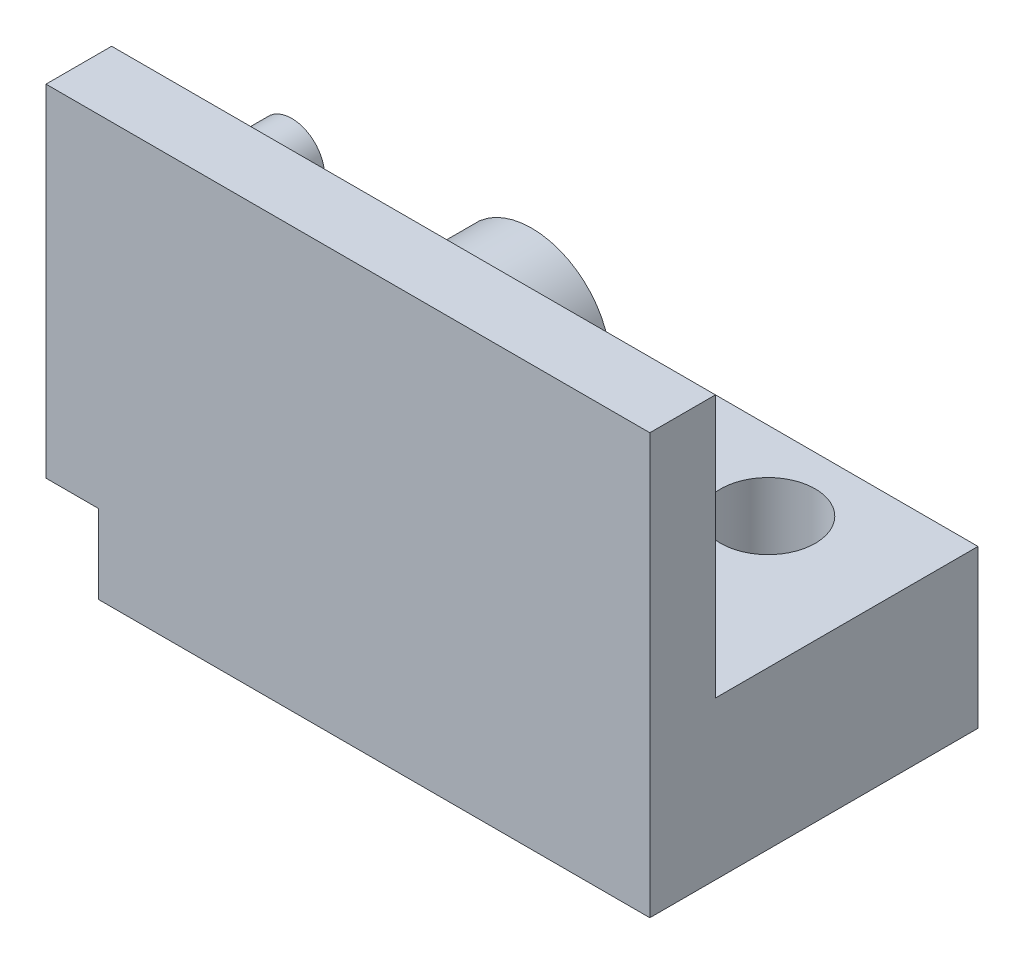
ISO-10303-21;
HEADER;
FILE_DESCRIPTION(('STEP AP214'),'2;1');
FILE_NAME('part.step','',(''),(''),'','','');
FILE_SCHEMA(('AUTOMOTIVE_DESIGN { 1 0 10303 214 1 1 1 1 }'));
ENDSEC;
DATA;
#1=APPLICATION_CONTEXT('core data for automotive mechanical design processes');
#2=APPLICATION_PROTOCOL_DEFINITION('international standard','automotive_design',2000,#1);
#3=PRODUCT_CONTEXT('',#1,'mechanical');
#4=PRODUCT('Part','Part','',(#3));
#5=PRODUCT_RELATED_PRODUCT_CATEGORY('part','',(#4));
#6=PRODUCT_DEFINITION_FORMATION('','',#4);
#7=PRODUCT_DEFINITION_CONTEXT('part definition',#1,'design');
#8=PRODUCT_DEFINITION('design','',#6,#7);
#9=PRODUCT_DEFINITION_SHAPE('','',#8);
#10=(LENGTH_UNIT() NAMED_UNIT(*) SI_UNIT(.MILLI.,.METRE.));
#11=(NAMED_UNIT(*) PLANE_ANGLE_UNIT() SI_UNIT($,.RADIAN.));
#12=(NAMED_UNIT(*) SI_UNIT($,.STERADIAN.) SOLID_ANGLE_UNIT());
#13=UNCERTAINTY_MEASURE_WITH_UNIT(LENGTH_MEASURE(1.E-05),#10,'distance_accuracy_value','');
#14=(GEOMETRIC_REPRESENTATION_CONTEXT(3) GLOBAL_UNCERTAINTY_ASSIGNED_CONTEXT((#13)) GLOBAL_UNIT_ASSIGNED_CONTEXT((#10,
#11,#12)) REPRESENTATION_CONTEXT('',''));
#15=CARTESIAN_POINT('',(0.,0.,0.));
#16=DIRECTION('',(0.,0.,1.));
#17=DIRECTION('',(1.,0.,0.));
#18=AXIS2_PLACEMENT_3D('',#15,#16,#17);
#19=CARTESIAN_POINT('',(0.,0.,0.));
#20=DIRECTION('',(0.,0.,1.));
#21=DIRECTION('',(1.,0.,0.));
#22=AXIS2_PLACEMENT_3D('',#19,#20,#21);
#23=PLANE('',#22);
#24=CARTESIAN_POINT('',(-43.0401414309484,-20.7011231281198,0.));
#25=DIRECTION('',(0.,0.,1.));
#26=DIRECTION('',(1.,0.,0.));
#27=AXIS2_PLACEMENT_3D('',#24,#25,#26);
#28=CIRCLE('',#27,3.);
#29=CARTESIAN_POINT('',(-40.0401414309484,-20.7011231281198,0.));
#30=VERTEX_POINT('',#29);
#31=EDGE_CURVE('E172',#30,#30,#28,.F.);
#32=ORIENTED_EDGE('',*,*,#31,.F.);
#33=EDGE_LOOP('',(#32));
#34=FACE_BOUND('',#33,.T.);
#35=DIRECTION('',(1.,0.,0.));
#36=VECTOR('',#35,1.);
#37=CARTESIAN_POINT('',(-47.0401414309484,-25.7011231281198,0.));
#38=LINE('',#37,#36);
#39=CARTESIAN_POINT('',(-47.0401414309484,-25.7011231281198,0.));
#40=VERTEX_POINT('',#39);
#41=CARTESIAN_POINT('',(-36.0401414309484,-25.7011231281198,0.));
#42=VERTEX_POINT('',#41);
#43=EDGE_CURVE('E169',#40,#42,#38,.T.);
#44=ORIENTED_EDGE('',*,*,#43,.F.);
#45=DIRECTION('',(0.,-1.,0.));
#46=VECTOR('',#45,1.);
#47=CARTESIAN_POINT('',(-47.0401414309484,-25.7011231281198,0.));
#48=LINE('',#47,#46);
#49=CARTESIAN_POINT('',(-47.0401414309484,-22.7011231281198,0.));
#50=VERTEX_POINT('',#49);
#51=EDGE_CURVE('E113',#50,#40,#48,.T.);
#52=ORIENTED_EDGE('',*,*,#51,.F.);
#53=DIRECTION('',(1.,0.,0.));
#54=VECTOR('',#53,1.);
#55=CARTESIAN_POINT('',(-49.0401414309484,-22.7011231281198,0.));
#56=LINE('',#55,#54);
#57=CARTESIAN_POINT('',(-49.0401414309484,-22.7011231281198,0.));
#58=VERTEX_POINT('',#57);
#59=EDGE_CURVE('E103',#58,#50,#56,.T.);
#60=ORIENTED_EDGE('',*,*,#59,.F.);
#61=DIRECTION('',(0.,-1.,0.));
#62=VECTOR('',#61,1.);
#63=CARTESIAN_POINT('',(-49.0401414309484,-25.7011231281198,0.));
#64=LINE('',#63,#62);
#65=CARTESIAN_POINT('',(-49.0401414309484,-9.70112312811981,0.));
#66=VERTEX_POINT('',#65);
#67=EDGE_CURVE('E111',#66,#58,#64,.T.);
#68=ORIENTED_EDGE('',*,*,#67,.F.);
#69=DIRECTION('',(1.,0.,0.));
#70=VECTOR('',#69,1.);
#71=CARTESIAN_POINT('',(-51.0401414309483,-9.70112312811981,0.));
#72=LINE('',#71,#70);
#73=CARTESIAN_POINT('',(-26.0401414309484,-9.70112312811981,0.));
#74=VERTEX_POINT('',#73);
#75=EDGE_CURVE('E128',#66,#74,#72,.T.);
#76=ORIENTED_EDGE('',*,*,#75,.T.);
#77=DIRECTION('',(0.,-1.,0.));
#78=VECTOR('',#77,1.);
#79=CARTESIAN_POINT('',(-26.0401414309484,0.,0.));
#80=LINE('',#79,#78);
#81=CARTESIAN_POINT('',(-26.0401414309484,-19.7011231281198,0.));
#82=VERTEX_POINT('',#81);
#83=EDGE_CURVE('E126',#74,#82,#80,.T.);
#84=ORIENTED_EDGE('',*,*,#83,.T.);
#85=DIRECTION('',(1.,0.,0.));
#86=VECTOR('',#85,1.);
#87=CARTESIAN_POINT('',(-26.0401414309484,-19.7011231281198,0.));
#88=LINE('',#87,#86);
#89=CARTESIAN_POINT('',(-36.0401414309484,-19.7011231281198,0.));
#90=VERTEX_POINT('',#89);
#91=EDGE_CURVE('E145',#90,#82,#88,.T.);
#92=ORIENTED_EDGE('',*,*,#91,.F.);
#93=DIRECTION('',(0.,1.,0.));
#94=VECTOR('',#93,1.);
#95=CARTESIAN_POINT('',(-36.0401414309484,-25.7011231281198,0.));
#96=LINE('',#95,#94);
#97=EDGE_CURVE('E138',#42,#90,#96,.T.);
#98=ORIENTED_EDGE('',*,*,#97,.F.);
#99=EDGE_LOOP('',(#44,#52,#60,#68,#76,#84,#92,#98));
#100=FACE_BOUND('',#99,.T.);
#101=CARTESIAN_POINT('',(-45.6801414309484,-13.4011231281198,0.));
#102=DIRECTION('',(0.,0.,1.));
#103=DIRECTION('',(1.,0.,0.));
#104=AXIS2_PLACEMENT_3D('',#101,#102,#103);
#105=CIRCLE('',#104,1.25);
#106=CARTESIAN_POINT('',(-44.4301414309484,-13.4011231281198,0.));
#107=VERTEX_POINT('',#106);
#108=EDGE_CURVE('E106',#107,#107,#105,.F.);
#109=ORIENTED_EDGE('',*,*,#108,.F.);
#110=EDGE_LOOP('',(#109));
#111=FACE_BOUND('',#110,.T.);
#112=ADVANCED_FACE('F32',(#34,#100,#111),#23,.F.);
#113=CARTESIAN_POINT('',(-47.0401414309484,-25.7011231281198,2.5));
#114=DIRECTION('',(0.,1.,0.));
#115=DIRECTION('',(0.,0.,1.));
#116=AXIS2_PLACEMENT_3D('',#113,#114,#115);
#117=PLANE('',#116);
#118=CARTESIAN_POINT('',(-31.0401414309484,-25.7011231281198,-7.));
#119=DIRECTION('',(0.,1.,0.));
#120=DIRECTION('',(0.,0.,1.));
#121=AXIS2_PLACEMENT_3D('',#118,#119,#120);
#122=CIRCLE('',#121,1.8);
#123=CARTESIAN_POINT('',(-31.0401414309484,-25.7011231281198,-5.2));
#124=VERTEX_POINT('',#123);
#125=EDGE_CURVE('E135',#124,#124,#122,.T.);
#126=ORIENTED_EDGE('',*,*,#125,.T.);
#127=EDGE_LOOP('',(#126));
#128=FACE_BOUND('',#127,.T.);
#129=DIRECTION('',(1.,0.,0.));
#130=VECTOR('',#129,1.);
#131=CARTESIAN_POINT('',(-47.0401414309484,-25.7011231281198,2.5));
#132=LINE('',#131,#130);
#133=CARTESIAN_POINT('',(-47.0401414309484,-25.7011231281198,2.5));
#134=VERTEX_POINT('',#133);
#135=CARTESIAN_POINT('',(-26.0401414309484,-25.7011231281198,2.5));
#136=VERTEX_POINT('',#135);
#137=EDGE_CURVE('E170',#134,#136,#132,.T.);
#138=ORIENTED_EDGE('',*,*,#137,.F.);
#139=DIRECTION('',(0.,0.,-1.));
#140=VECTOR('',#139,1.);
#141=CARTESIAN_POINT('',(-47.0401414309484,-25.7011231281198,10.));
#142=LINE('',#141,#140);
#143=EDGE_CURVE('E247',#134,#40,#142,.T.);
#144=ORIENTED_EDGE('',*,*,#143,.T.);
#145=ORIENTED_EDGE('',*,*,#43,.T.);
#146=DIRECTION('',(0.,0.,1.));
#147=VECTOR('',#146,1.);
#148=CARTESIAN_POINT('',(-36.0401414309484,-25.7011231281198,-10.));
#149=LINE('',#148,#147);
#150=CARTESIAN_POINT('',(-36.0401414309484,-25.7011231281198,-10.));
#151=VERTEX_POINT('',#150);
#152=EDGE_CURVE('E160',#151,#42,#149,.T.);
#153=ORIENTED_EDGE('',*,*,#152,.F.);
#154=DIRECTION('',(-1.,0.,0.));
#155=VECTOR('',#154,1.);
#156=CARTESIAN_POINT('',(-26.0401414309484,-25.7011231281198,-10.));
#157=LINE('',#156,#155);
#158=CARTESIAN_POINT('',(-26.0401414309484,-25.7011231281198,-10.));
#159=VERTEX_POINT('',#158);
#160=EDGE_CURVE('E144',#159,#151,#157,.T.);
#161=ORIENTED_EDGE('',*,*,#160,.F.);
#162=DIRECTION('',(0.,0.,1.));
#163=VECTOR('',#162,1.);
#164=CARTESIAN_POINT('',(-26.0401414309484,-25.7011231281198,-10.));
#165=LINE('',#164,#163);
#166=EDGE_CURVE('E163',#159,#136,#165,.T.);
#167=ORIENTED_EDGE('',*,*,#166,.T.);
#168=EDGE_LOOP('',(#138,#144,#145,#153,#161,#167));
#169=FACE_BOUND('',#168,.T.);
#170=ADVANCED_FACE('F34',(#128,#169),#117,.F.);
#171=CARTESIAN_POINT('',(0.,0.,2.5));
#172=DIRECTION('',(0.,0.,1.));
#173=DIRECTION('',(1.,0.,0.));
#174=AXIS2_PLACEMENT_3D('',#171,#172,#173);
#175=PLANE('',#174);
#176=DIRECTION('',(0.,1.,0.));
#177=VECTOR('',#176,1.);
#178=CARTESIAN_POINT('',(-47.0401414309484,0.,2.5));
#179=LINE('',#178,#177);
#180=CARTESIAN_POINT('',(-47.0401414309484,-22.7011231281198,2.5));
#181=VERTEX_POINT('',#180);
#182=EDGE_CURVE('E11',#134,#181,#179,.T.);
#183=ORIENTED_EDGE('',*,*,#182,.F.);
#184=ORIENTED_EDGE('',*,*,#137,.T.);
#185=DIRECTION('',(0.,-1.,0.));
#186=VECTOR('',#185,1.);
#187=CARTESIAN_POINT('',(-26.0401414309484,0.,2.5));
#188=LINE('',#187,#186);
#189=CARTESIAN_POINT('',(-26.0401414309484,-9.70112312811981,2.5));
#190=VERTEX_POINT('',#189);
#191=EDGE_CURVE('E125',#190,#136,#188,.T.);
#192=ORIENTED_EDGE('',*,*,#191,.F.);
#193=DIRECTION('',(1.,0.,0.));
#194=VECTOR('',#193,1.);
#195=CARTESIAN_POINT('',(-51.0401414309483,-9.70112312811981,2.5));
#196=LINE('',#195,#194);
#197=CARTESIAN_POINT('',(-49.0401414309484,-9.70112312811981,2.5));
#198=VERTEX_POINT('',#197);
#199=EDGE_CURVE('E131',#198,#190,#196,.T.);
#200=ORIENTED_EDGE('',*,*,#199,.F.);
#201=DIRECTION('',(0.,1.,0.));
#202=VECTOR('',#201,1.);
#203=CARTESIAN_POINT('',(-49.0401414309484,0.,2.5));
#204=LINE('',#203,#202);
#205=CARTESIAN_POINT('',(-49.0401414309484,-22.7011231281198,2.5));
#206=VERTEX_POINT('',#205);
#207=EDGE_CURVE('E54',#206,#198,#204,.T.);
#208=ORIENTED_EDGE('',*,*,#207,.F.);
#209=DIRECTION('',(-1.,0.,0.));
#210=VECTOR('',#209,1.);
#211=CARTESIAN_POINT('',(0.,-22.7011231281198,2.5));
#212=LINE('',#211,#210);
#213=EDGE_CURVE('E47',#181,#206,#212,.T.);
#214=ORIENTED_EDGE('',*,*,#213,.F.);
#215=EDGE_LOOP('',(#183,#184,#192,#200,#208,#214));
#216=FACE_BOUND('',#215,.T.);
#217=ADVANCED_FACE('F189',(#216),#175,.T.);
#218=CARTESIAN_POINT('',(-43.0401414309484,-20.7011231281198,-10.));
#219=DIRECTION('',(0.,0.,1.));
#220=DIRECTION('',(1.,0.,0.));
#221=AXIS2_PLACEMENT_3D('',#218,#219,#220);
#222=CYLINDRICAL_SURFACE('',#221,3.);
#223=CARTESIAN_POINT('',(-43.0401414309484,-20.7011231281198,-10.));
#224=DIRECTION('',(0.,0.,-1.));
#225=DIRECTION('',(-1.,0.,0.));
#226=AXIS2_PLACEMENT_3D('',#223,#224,#225);
#227=CIRCLE('',#226,3.);
#228=CARTESIAN_POINT('',(-46.0401414309484,-20.7011231281198,-10.));
#229=VERTEX_POINT('',#228);
#230=EDGE_CURVE('E166',#229,#229,#227,.T.);
#231=ORIENTED_EDGE('',*,*,#230,.F.);
#232=EDGE_LOOP('',(#231));
#233=FACE_BOUND('',#232,.T.);
#234=ORIENTED_EDGE('',*,*,#31,.T.);
#235=EDGE_LOOP('',(#234));
#236=FACE_BOUND('',#235,.T.);
#237=ADVANCED_FACE('F195',(#233,#236),#222,.T.);
#238=CARTESIAN_POINT('',(-43.0401414309484,-20.7011231281198,-10.));
#239=DIRECTION('',(0.,0.,-1.));
#240=DIRECTION('',(-1.,0.,0.));
#241=AXIS2_PLACEMENT_3D('',#238,#239,#240);
#242=PLANE('',#241);
#243=ORIENTED_EDGE('',*,*,#230,.T.);
#244=EDGE_LOOP('',(#243));
#245=FACE_BOUND('',#244,.T.);
#246=ADVANCED_FACE('F199',(#245),#242,.T.);
#247=CARTESIAN_POINT('',(-26.0401414309484,-25.7011231281198,-10.));
#248=DIRECTION('',(-1.,0.,0.));
#249=DIRECTION('',(0.,0.,1.));
#250=AXIS2_PLACEMENT_3D('',#247,#248,#249);
#251=PLANE('',#250);
#252=ORIENTED_EDGE('',*,*,#83,.F.);
#253=DIRECTION('',(0.,0.,1.));
#254=VECTOR('',#253,1.);
#255=CARTESIAN_POINT('',(-26.0401414309484,-9.70112312811981,-10.));
#256=LINE('',#255,#254);
#257=EDGE_CURVE('E176',#74,#190,#256,.T.);
#258=ORIENTED_EDGE('',*,*,#257,.T.);
#259=ORIENTED_EDGE('',*,*,#191,.T.);
#260=ORIENTED_EDGE('',*,*,#166,.F.);
#261=DIRECTION('',(0.,-1.,0.));
#262=VECTOR('',#261,1.);
#263=CARTESIAN_POINT('',(-26.0401414309484,-25.7011231281198,-10.));
#264=LINE('',#263,#262);
#265=CARTESIAN_POINT('',(-26.0401414309484,-19.7011231281198,-10.));
#266=VERTEX_POINT('',#265);
#267=EDGE_CURVE('E141',#266,#159,#264,.T.);
#268=ORIENTED_EDGE('',*,*,#267,.F.);
#269=DIRECTION('',(0.,0.,1.));
#270=VECTOR('',#269,1.);
#271=CARTESIAN_POINT('',(-26.0401414309484,-19.7011231281198,-10.));
#272=LINE('',#271,#270);
#273=EDGE_CURVE('E151',#266,#82,#272,.T.);
#274=ORIENTED_EDGE('',*,*,#273,.T.);
#275=EDGE_LOOP('',(#252,#258,#259,#260,#268,#274));
#276=FACE_BOUND('',#275,.T.);
#277=ADVANCED_FACE('F203',(#276),#251,.F.);
#278=CARTESIAN_POINT('',(-36.0401414309484,-25.7011231281198,-10.));
#279=DIRECTION('',(1.,0.,0.));
#280=DIRECTION('',(0.,0.,-1.));
#281=AXIS2_PLACEMENT_3D('',#278,#279,#280);
#282=PLANE('',#281);
#283=ORIENTED_EDGE('',*,*,#97,.T.);
#284=DIRECTION('',(0.,0.,1.));
#285=VECTOR('',#284,1.);
#286=CARTESIAN_POINT('',(-36.0401414309484,-19.7011231281198,-10.));
#287=LINE('',#286,#285);
#288=CARTESIAN_POINT('',(-36.0401414309484,-19.7011231281198,-10.));
#289=VERTEX_POINT('',#288);
#290=EDGE_CURVE('E157',#289,#90,#287,.T.);
#291=ORIENTED_EDGE('',*,*,#290,.F.);
#292=DIRECTION('',(0.,1.,0.));
#293=VECTOR('',#292,1.);
#294=CARTESIAN_POINT('',(-36.0401414309484,-25.7011231281198,-10.));
#295=LINE('',#294,#293);
#296=EDGE_CURVE('E147',#151,#289,#295,.T.);
#297=ORIENTED_EDGE('',*,*,#296,.F.);
#298=ORIENTED_EDGE('',*,*,#152,.T.);
#299=EDGE_LOOP('',(#283,#291,#297,#298));
#300=FACE_BOUND('',#299,.T.);
#301=ADVANCED_FACE('F207',(#300),#282,.F.);
#302=CARTESIAN_POINT('',(-26.0401414309484,-19.7011231281198,-10.));
#303=DIRECTION('',(0.,-1.,0.));
#304=DIRECTION('',(0.,0.,-1.));
#305=AXIS2_PLACEMENT_3D('',#302,#303,#304);
#306=PLANE('',#305);
#307=CARTESIAN_POINT('',(-31.0401414309484,-19.7011231281198,-7.));
#308=DIRECTION('',(0.,1.,0.));
#309=DIRECTION('',(0.,0.,1.));
#310=AXIS2_PLACEMENT_3D('',#307,#308,#309);
#311=CIRCLE('',#310,1.8);
#312=CARTESIAN_POINT('',(-31.0401414309484,-19.7011231281198,-5.2));
#313=VERTEX_POINT('',#312);
#314=EDGE_CURVE('E133',#313,#313,#311,.T.);
#315=ORIENTED_EDGE('',*,*,#314,.F.);
#316=EDGE_LOOP('',(#315));
#317=FACE_BOUND('',#316,.T.);
#318=ORIENTED_EDGE('',*,*,#91,.T.);
#319=ORIENTED_EDGE('',*,*,#273,.F.);
#320=DIRECTION('',(1.,0.,0.));
#321=VECTOR('',#320,1.);
#322=CARTESIAN_POINT('',(-26.0401414309484,-19.7011231281198,-10.));
#323=LINE('',#322,#321);
#324=EDGE_CURVE('E149',#289,#266,#323,.T.);
#325=ORIENTED_EDGE('',*,*,#324,.F.);
#326=ORIENTED_EDGE('',*,*,#290,.T.);
#327=EDGE_LOOP('',(#318,#319,#325,#326));
#328=FACE_BOUND('',#327,.T.);
#329=ADVANCED_FACE('F211',(#317,#328),#306,.F.);
#330=CARTESIAN_POINT('',(0.,0.,-10.));
#331=DIRECTION('',(0.,0.,1.));
#332=DIRECTION('',(1.,0.,0.));
#333=AXIS2_PLACEMENT_3D('',#330,#331,#332);
#334=PLANE('',#333);
#335=ORIENTED_EDGE('',*,*,#267,.T.);
#336=ORIENTED_EDGE('',*,*,#160,.T.);
#337=ORIENTED_EDGE('',*,*,#296,.T.);
#338=ORIENTED_EDGE('',*,*,#324,.T.);
#339=EDGE_LOOP('',(#335,#336,#337,#338));
#340=FACE_BOUND('',#339,.T.);
#341=ADVANCED_FACE('F215',(#340),#334,.F.);
#342=CARTESIAN_POINT('',(-31.0401414309484,-25.7011231281198,-7.));
#343=DIRECTION('',(0.,1.,0.));
#344=DIRECTION('',(0.,0.,1.));
#345=AXIS2_PLACEMENT_3D('',#342,#343,#344);
#346=CYLINDRICAL_SURFACE('',#345,1.8);
#347=ORIENTED_EDGE('',*,*,#125,.F.);
#348=EDGE_LOOP('',(#347));
#349=FACE_BOUND('',#348,.T.);
#350=ORIENTED_EDGE('',*,*,#314,.T.);
#351=EDGE_LOOP('',(#350));
#352=FACE_BOUND('',#351,.T.);
#353=ADVANCED_FACE('F219',(#349,#352),#346,.F.);
#354=CARTESIAN_POINT('',(-51.0401414309483,-9.70112312811981,2.5));
#355=DIRECTION('',(0.,1.,0.));
#356=DIRECTION('',(0.,0.,1.));
#357=AXIS2_PLACEMENT_3D('',#354,#355,#356);
#358=PLANE('',#357);
#359=DIRECTION('',(0.,0.,-1.));
#360=VECTOR('',#359,1.);
#361=CARTESIAN_POINT('',(-49.0401414309484,-9.70112312811981,10.));
#362=LINE('',#361,#360);
#363=EDGE_CURVE('E116',#198,#66,#362,.T.);
#364=ORIENTED_EDGE('',*,*,#363,.F.);
#365=ORIENTED_EDGE('',*,*,#199,.T.);
#366=ORIENTED_EDGE('',*,*,#257,.F.);
#367=ORIENTED_EDGE('',*,*,#75,.F.);
#368=EDGE_LOOP('',(#364,#365,#366,#367));
#369=FACE_BOUND('',#368,.T.);
#370=ADVANCED_FACE('F223',(#369),#358,.T.);
#371=CARTESIAN_POINT('',(-49.0401414309484,-25.7011231281198,10.));
#372=DIRECTION('',(1.,0.,0.));
#373=DIRECTION('',(0.,0.,-1.));
#374=AXIS2_PLACEMENT_3D('',#371,#372,#373);
#375=PLANE('',#374);
#376=ORIENTED_EDGE('',*,*,#67,.T.);
#377=DIRECTION('',(0.,0.,1.));
#378=VECTOR('',#377,1.);
#379=CARTESIAN_POINT('',(-49.0401414309484,-22.7011231281198,10.));
#380=LINE('',#379,#378);
#381=EDGE_CURVE('E40',#58,#206,#380,.T.);
#382=ORIENTED_EDGE('',*,*,#381,.T.);
#383=ORIENTED_EDGE('',*,*,#207,.T.);
#384=ORIENTED_EDGE('',*,*,#363,.T.);
#385=EDGE_LOOP('',(#376,#382,#383,#384));
#386=FACE_BOUND('',#385,.T.);
#387=ADVANCED_FACE('F115',(#386),#375,.F.);
#388=CARTESIAN_POINT('',(-45.6801414309484,-13.4011231281198,-3.5));
#389=DIRECTION('',(0.,0.,1.));
#390=DIRECTION('',(1.,0.,0.));
#391=AXIS2_PLACEMENT_3D('',#388,#389,#390);
#392=CYLINDRICAL_SURFACE('',#391,1.25);
#393=CARTESIAN_POINT('',(-45.6801414309484,-13.4011231281198,-3.5));
#394=DIRECTION('',(0.,0.,-1.));
#395=DIRECTION('',(-1.,0.,0.));
#396=AXIS2_PLACEMENT_3D('',#393,#394,#395);
#397=CIRCLE('',#396,1.25);
#398=CARTESIAN_POINT('',(-46.9301414309484,-13.4011231281198,-3.5));
#399=VERTEX_POINT('',#398);
#400=EDGE_CURVE('E117',#399,#399,#397,.T.);
#401=ORIENTED_EDGE('',*,*,#400,.F.);
#402=EDGE_LOOP('',(#401));
#403=FACE_BOUND('',#402,.T.);
#404=ORIENTED_EDGE('',*,*,#108,.T.);
#405=EDGE_LOOP('',(#404));
#406=FACE_BOUND('',#405,.T.);
#407=ADVANCED_FACE('F182',(#403,#406),#392,.T.);
#408=CARTESIAN_POINT('',(-45.6801414309484,-13.4011231281198,-3.5));
#409=DIRECTION('',(0.,0.,-1.));
#410=DIRECTION('',(-1.,0.,0.));
#411=AXIS2_PLACEMENT_3D('',#408,#409,#410);
#412=PLANE('',#411);
#413=ORIENTED_EDGE('',*,*,#400,.T.);
#414=EDGE_LOOP('',(#413));
#415=FACE_BOUND('',#414,.T.);
#416=ADVANCED_FACE('F232',(#415),#412,.T.);
#417=CARTESIAN_POINT('',(-47.0401414309484,-25.7011231281198,10.));
#418=DIRECTION('',(1.,0.,0.));
#419=DIRECTION('',(0.,0.,-1.));
#420=AXIS2_PLACEMENT_3D('',#417,#418,#419);
#421=PLANE('',#420);
#422=ORIENTED_EDGE('',*,*,#182,.T.);
#423=DIRECTION('',(0.,0.,-1.));
#424=VECTOR('',#423,1.);
#425=CARTESIAN_POINT('',(-47.0401414309484,-22.7011231281198,10.));
#426=LINE('',#425,#424);
#427=EDGE_CURVE('E245',#181,#50,#426,.T.);
#428=ORIENTED_EDGE('',*,*,#427,.T.);
#429=ORIENTED_EDGE('',*,*,#51,.T.);
#430=ORIENTED_EDGE('',*,*,#143,.F.);
#431=EDGE_LOOP('',(#422,#428,#429,#430));
#432=FACE_BOUND('',#431,.T.);
#433=ADVANCED_FACE('F236',(#432),#421,.F.);
#434=CARTESIAN_POINT('',(-49.0401414309484,-22.7011231281198,10.));
#435=DIRECTION('',(0.,1.,0.));
#436=DIRECTION('',(0.,0.,1.));
#437=AXIS2_PLACEMENT_3D('',#434,#435,#436);
#438=PLANE('',#437);
#439=ORIENTED_EDGE('',*,*,#213,.T.);
#440=ORIENTED_EDGE('',*,*,#381,.F.);
#441=ORIENTED_EDGE('',*,*,#59,.T.);
#442=ORIENTED_EDGE('',*,*,#427,.F.);
#443=EDGE_LOOP('',(#439,#440,#441,#442));
#444=FACE_BOUND('',#443,.T.);
#445=ADVANCED_FACE('F102',(#444),#438,.F.);
#446=CLOSED_SHELL('',(#112,#170,#217,#237,#246,#277,#301,#329,#341,#353,#370,#387,#407,#416,
#433,#445));
#447=MANIFOLD_SOLID_BREP('B2',#446);
#448=ADVANCED_BREP_SHAPE_REPRESENTATION('',(#18,#447),#14);
#449=SHAPE_DEFINITION_REPRESENTATION(#9,#448);
ENDSEC;
END-ISO-10303-21;
